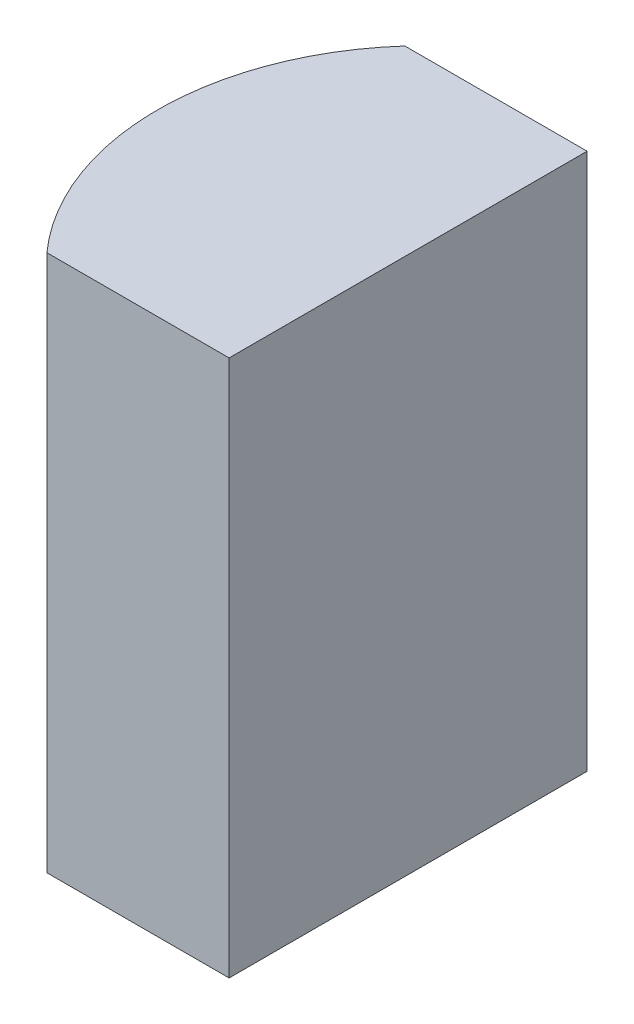
ISO-10303-21;
HEADER;
FILE_DESCRIPTION(('STEP AP214'),'2;1');
FILE_NAME('part.step','',(''),(''),'','','');
FILE_SCHEMA(('AUTOMOTIVE_DESIGN { 1 0 10303 214 1 1 1 1 }'));
ENDSEC;
DATA;
#1=APPLICATION_CONTEXT('core data for automotive mechanical design processes');
#2=APPLICATION_PROTOCOL_DEFINITION('international standard','automotive_design',2000,#1);
#3=PRODUCT_CONTEXT('',#1,'mechanical');
#4=PRODUCT('Part','Part','',(#3));
#5=PRODUCT_RELATED_PRODUCT_CATEGORY('part','',(#4));
#6=PRODUCT_DEFINITION_FORMATION('','',#4);
#7=PRODUCT_DEFINITION_CONTEXT('part definition',#1,'design');
#8=PRODUCT_DEFINITION('design','',#6,#7);
#9=PRODUCT_DEFINITION_SHAPE('','',#8);
#10=(LENGTH_UNIT() NAMED_UNIT(*) SI_UNIT(.MILLI.,.METRE.));
#11=(NAMED_UNIT(*) PLANE_ANGLE_UNIT() SI_UNIT($,.RADIAN.));
#12=(NAMED_UNIT(*) SI_UNIT($,.STERADIAN.) SOLID_ANGLE_UNIT());
#13=UNCERTAINTY_MEASURE_WITH_UNIT(LENGTH_MEASURE(1.E-05),#10,'distance_accuracy_value','');
#14=(GEOMETRIC_REPRESENTATION_CONTEXT(3) GLOBAL_UNCERTAINTY_ASSIGNED_CONTEXT((#13)) GLOBAL_UNIT_ASSIGNED_CONTEXT((#10,
#11,#12)) REPRESENTATION_CONTEXT('',''));
#15=CARTESIAN_POINT('',(0.,0.,0.));
#16=DIRECTION('',(0.,0.,1.));
#17=DIRECTION('',(1.,0.,0.));
#18=AXIS2_PLACEMENT_3D('',#15,#16,#17);
#19=CARTESIAN_POINT('',(0.,6.,0.));
#20=DIRECTION('',(0.,0.,1.));
#21=DIRECTION('',(1.,0.,0.));
#22=AXIS2_PLACEMENT_3D('',#19,#20,#21);
#23=PLANE('',#22);
#24=DIRECTION('',(-1.,0.,0.));
#25=VECTOR('',#24,1.);
#26=CARTESIAN_POINT('',(0.,0.,0.));
#27=LINE('',#26,#25);
#28=CARTESIAN_POINT('',(0.,0.,0.));
#29=VERTEX_POINT('',#28);
#30=CARTESIAN_POINT('',(-2.03606797749979,0.,0.));
#31=VERTEX_POINT('',#30);
#32=EDGE_CURVE('E100',#29,#31,#27,.T.);
#33=ORIENTED_EDGE('',*,*,#32,.T.);
#34=DIRECTION('',(0.,-1.,0.));
#35=VECTOR('',#34,1.);
#36=CARTESIAN_POINT('',(-2.03606797749979,6.,0.));
#37=LINE('',#36,#35);
#38=CARTESIAN_POINT('',(-2.03606797749979,6.,0.));
#39=VERTEX_POINT('',#38);
#40=EDGE_CURVE('E11',#39,#31,#37,.T.);
#41=ORIENTED_EDGE('',*,*,#40,.F.);
#42=DIRECTION('',(-1.,0.,0.));
#43=VECTOR('',#42,1.);
#44=CARTESIAN_POINT('',(0.,6.,0.));
#45=LINE('',#44,#43);
#46=CARTESIAN_POINT('',(0.,6.,0.));
#47=VERTEX_POINT('',#46);
#48=EDGE_CURVE('E88',#47,#39,#45,.T.);
#49=ORIENTED_EDGE('',*,*,#48,.F.);
#50=DIRECTION('',(0.,-1.,0.));
#51=VECTOR('',#50,1.);
#52=CARTESIAN_POINT('',(0.,6.,0.));
#53=LINE('',#52,#51);
#54=EDGE_CURVE('E96',#47,#29,#53,.T.);
#55=ORIENTED_EDGE('',*,*,#54,.T.);
#56=EDGE_LOOP('',(#33,#41,#49,#55));
#57=FACE_BOUND('',#56,.T.);
#58=ADVANCED_FACE('F37',(#57),#23,.F.);
#59=CARTESIAN_POINT('',(0.200000000000001,6.,2.));
#60=DIRECTION('',(0.,-1.,0.));
#61=DIRECTION('',(0.,0.,-1.));
#62=AXIS2_PLACEMENT_3D('',#59,#60,#61);
#63=CYLINDRICAL_SURFACE('',#62,3.);
#64=CARTESIAN_POINT('',(0.200000000000001,0.,2.));
#65=DIRECTION('',(0.,1.,0.));
#66=DIRECTION('',(0.,0.,1.));
#67=AXIS2_PLACEMENT_3D('',#64,#65,#66);
#68=CIRCLE('',#67,3.);
#69=CARTESIAN_POINT('',(-2.03606797749979,0.,4.));
#70=VERTEX_POINT('',#69);
#71=EDGE_CURVE('E92',#31,#70,#68,.T.);
#72=ORIENTED_EDGE('',*,*,#71,.T.);
#73=DIRECTION('',(0.,-1.,0.));
#74=VECTOR('',#73,1.);
#75=CARTESIAN_POINT('',(-2.03606797749979,6.,4.));
#76=LINE('',#75,#74);
#77=CARTESIAN_POINT('',(-2.03606797749979,6.,4.));
#78=VERTEX_POINT('',#77);
#79=EDGE_CURVE('E45',#78,#70,#76,.T.);
#80=ORIENTED_EDGE('',*,*,#79,.F.);
#81=CARTESIAN_POINT('',(0.200000000000001,6.,2.));
#82=DIRECTION('',(0.,1.,0.));
#83=DIRECTION('',(0.,0.,1.));
#84=AXIS2_PLACEMENT_3D('',#81,#82,#83);
#85=CIRCLE('',#84,3.);
#86=EDGE_CURVE('E83',#39,#78,#85,.T.);
#87=ORIENTED_EDGE('',*,*,#86,.F.);
#88=ORIENTED_EDGE('',*,*,#40,.T.);
#89=EDGE_LOOP('',(#72,#80,#87,#88));
#90=FACE_BOUND('',#89,.T.);
#91=ADVANCED_FACE('F91',(#90),#63,.T.);
#92=CARTESIAN_POINT('',(0.,6.,4.));
#93=DIRECTION('',(0.,0.,-1.));
#94=DIRECTION('',(-1.,0.,0.));
#95=AXIS2_PLACEMENT_3D('',#92,#93,#94);
#96=PLANE('',#95);
#97=DIRECTION('',(1.,0.,0.));
#98=VECTOR('',#97,1.);
#99=CARTESIAN_POINT('',(0.,0.,4.));
#100=LINE('',#99,#98);
#101=CARTESIAN_POINT('',(0.,0.,4.));
#102=VERTEX_POINT('',#101);
#103=EDGE_CURVE('E70',#70,#102,#100,.T.);
#104=ORIENTED_EDGE('',*,*,#103,.T.);
#105=DIRECTION('',(0.,-1.,0.));
#106=VECTOR('',#105,1.);
#107=CARTESIAN_POINT('',(0.,6.,4.));
#108=LINE('',#107,#106);
#109=CARTESIAN_POINT('',(0.,6.,4.));
#110=VERTEX_POINT('',#109);
#111=EDGE_CURVE('E93',#110,#102,#108,.T.);
#112=ORIENTED_EDGE('',*,*,#111,.F.);
#113=DIRECTION('',(1.,0.,0.));
#114=VECTOR('',#113,1.);
#115=CARTESIAN_POINT('',(0.,6.,4.));
#116=LINE('',#115,#114);
#117=EDGE_CURVE('E86',#78,#110,#116,.T.);
#118=ORIENTED_EDGE('',*,*,#117,.F.);
#119=ORIENTED_EDGE('',*,*,#79,.T.);
#120=EDGE_LOOP('',(#104,#112,#118,#119));
#121=FACE_BOUND('',#120,.T.);
#122=ADVANCED_FACE('F94',(#121),#96,.F.);
#123=CARTESIAN_POINT('',(0.,6.,0.));
#124=DIRECTION('',(-1.,0.,0.));
#125=DIRECTION('',(0.,0.,1.));
#126=AXIS2_PLACEMENT_3D('',#123,#124,#125);
#127=PLANE('',#126);
#128=DIRECTION('',(0.,0.,-1.));
#129=VECTOR('',#128,1.);
#130=CARTESIAN_POINT('',(0.,0.,0.));
#131=LINE('',#130,#129);
#132=EDGE_CURVE('E76',#102,#29,#131,.T.);
#133=ORIENTED_EDGE('',*,*,#132,.T.);
#134=ORIENTED_EDGE('',*,*,#54,.F.);
#135=DIRECTION('',(0.,0.,-1.));
#136=VECTOR('',#135,1.);
#137=CARTESIAN_POINT('',(0.,6.,0.));
#138=LINE('',#137,#136);
#139=EDGE_CURVE('E53',#110,#47,#138,.T.);
#140=ORIENTED_EDGE('',*,*,#139,.F.);
#141=ORIENTED_EDGE('',*,*,#111,.T.);
#142=EDGE_LOOP('',(#133,#134,#140,#141));
#143=FACE_BOUND('',#142,.T.);
#144=ADVANCED_FACE('F107',(#143),#127,.F.);
#145=CARTESIAN_POINT('',(0.200000000000001,6.,2.));
#146=DIRECTION('',(0.,1.,0.));
#147=DIRECTION('',(0.,0.,1.));
#148=AXIS2_PLACEMENT_3D('',#145,#146,#147);
#149=PLANE('',#148);
#150=ORIENTED_EDGE('',*,*,#48,.T.);
#151=ORIENTED_EDGE('',*,*,#86,.T.);
#152=ORIENTED_EDGE('',*,*,#117,.T.);
#153=ORIENTED_EDGE('',*,*,#139,.T.);
#154=EDGE_LOOP('',(#150,#151,#152,#153));
#155=FACE_BOUND('',#154,.T.);
#156=ADVANCED_FACE('F84',(#155),#149,.T.);
#157=CARTESIAN_POINT('',(0.200000000000001,0.,2.));
#158=DIRECTION('',(0.,1.,0.));
#159=DIRECTION('',(0.,0.,1.));
#160=AXIS2_PLACEMENT_3D('',#157,#158,#159);
#161=PLANE('',#160);
#162=ORIENTED_EDGE('',*,*,#32,.F.);
#163=ORIENTED_EDGE('',*,*,#132,.F.);
#164=ORIENTED_EDGE('',*,*,#103,.F.);
#165=ORIENTED_EDGE('',*,*,#71,.F.);
#166=EDGE_LOOP('',(#162,#163,#164,#165));
#167=FACE_BOUND('',#166,.T.);
#168=ADVANCED_FACE('F110',(#167),#161,.F.);
#169=CLOSED_SHELL('',(#58,#91,#122,#144,#156,#168));
#170=MANIFOLD_SOLID_BREP('B2',#169);
#171=ADVANCED_BREP_SHAPE_REPRESENTATION('',(#18,#170),#14);
#172=SHAPE_DEFINITION_REPRESENTATION(#9,#171);
ENDSEC;
END-ISO-10303-21;
